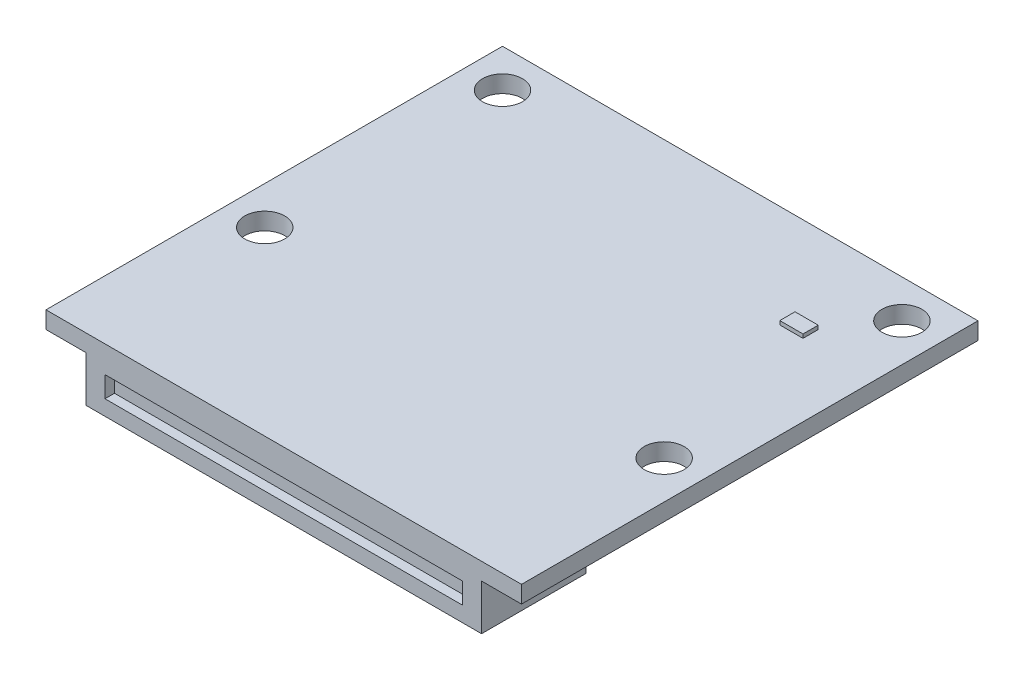
ISO-10303-21;
HEADER;
FILE_DESCRIPTION(('STEP AP214'),'2;1');
FILE_NAME('part.step','',(''),(''),'','','');
FILE_SCHEMA(('AUTOMOTIVE_DESIGN { 1 0 10303 214 1 1 1 1 }'));
ENDSEC;
DATA;
#1=APPLICATION_CONTEXT('core data for automotive mechanical design processes');
#2=APPLICATION_PROTOCOL_DEFINITION('international standard','automotive_design',2000,#1);
#3=PRODUCT_CONTEXT('',#1,'mechanical');
#4=PRODUCT('Part','Part','',(#3));
#5=PRODUCT_RELATED_PRODUCT_CATEGORY('part','',(#4));
#6=PRODUCT_DEFINITION_FORMATION('','',#4);
#7=PRODUCT_DEFINITION_CONTEXT('part definition',#1,'design');
#8=PRODUCT_DEFINITION('design','',#6,#7);
#9=PRODUCT_DEFINITION_SHAPE('','',#8);
#10=(LENGTH_UNIT() NAMED_UNIT(*) SI_UNIT(.MILLI.,.METRE.));
#11=(NAMED_UNIT(*) PLANE_ANGLE_UNIT() SI_UNIT($,.RADIAN.));
#12=(NAMED_UNIT(*) SI_UNIT($,.STERADIAN.) SOLID_ANGLE_UNIT());
#13=UNCERTAINTY_MEASURE_WITH_UNIT(LENGTH_MEASURE(1.E-05),#10,'distance_accuracy_value','');
#14=(GEOMETRIC_REPRESENTATION_CONTEXT(3) GLOBAL_UNCERTAINTY_ASSIGNED_CONTEXT((#13)) GLOBAL_UNIT_ASSIGNED_CONTEXT((#10,
#11,#12)) REPRESENTATION_CONTEXT('',''));
#15=CARTESIAN_POINT('',(0.,0.,0.));
#16=DIRECTION('',(0.,0.,1.));
#17=DIRECTION('',(1.,0.,0.));
#18=AXIS2_PLACEMENT_3D('',#15,#16,#17);
#19=CARTESIAN_POINT('',(0.,0.,0.));
#20=DIRECTION('',(0.,1.,0.));
#21=DIRECTION('',(0.,0.,1.));
#22=AXIS2_PLACEMENT_3D('',#19,#20,#21);
#23=PLANE('',#22);
#24=DIRECTION('',(0.,0.,1.));
#25=VECTOR('',#24,1.);
#26=CARTESIAN_POINT('',(-12.5,0.,-14.5));
#27=LINE('',#26,#25);
#28=CARTESIAN_POINT('',(-12.5,0.,-14.5));
#29=VERTEX_POINT('',#28);
#30=CARTESIAN_POINT('',(-12.5,0.,9.5));
#31=VERTEX_POINT('',#30);
#32=EDGE_CURVE('E272',#29,#31,#27,.T.);
#33=ORIENTED_EDGE('',*,*,#32,.T.);
#34=DIRECTION('',(1.,0.,0.));
#35=VECTOR('',#34,1.);
#36=CARTESIAN_POINT('',(-12.5,0.,9.5));
#37=LINE('',#36,#35);
#38=CARTESIAN_POINT('',(12.5,0.,9.5));
#39=VERTEX_POINT('',#38);
#40=EDGE_CURVE('E275',#31,#39,#37,.T.);
#41=ORIENTED_EDGE('',*,*,#40,.T.);
#42=DIRECTION('',(0.,0.,-1.));
#43=VECTOR('',#42,1.);
#44=CARTESIAN_POINT('',(12.5,0.,-14.5));
#45=LINE('',#44,#43);
#46=CARTESIAN_POINT('',(12.5,0.,-14.5));
#47=VERTEX_POINT('',#46);
#48=EDGE_CURVE('E279',#39,#47,#45,.T.);
#49=ORIENTED_EDGE('',*,*,#48,.T.);
#50=DIRECTION('',(-1.,0.,0.));
#51=VECTOR('',#50,1.);
#52=CARTESIAN_POINT('',(-12.5,0.,-14.5));
#53=LINE('',#52,#51);
#54=EDGE_CURVE('E282',#47,#29,#53,.T.);
#55=ORIENTED_EDGE('',*,*,#54,.T.);
#56=EDGE_LOOP('',(#33,#41,#49,#55));
#57=FACE_BOUND('',#56,.T.);
#58=CARTESIAN_POINT('',(10.5,0.,-12.5));
#59=DIRECTION('',(0.,1.,0.));
#60=DIRECTION('',(0.,0.,1.));
#61=AXIS2_PLACEMENT_3D('',#58,#59,#60);
#62=CIRCLE('',#61,1.05);
#63=CARTESIAN_POINT('',(10.5,0.,-11.45));
#64=VERTEX_POINT('',#63);
#65=EDGE_CURVE('E334',#64,#64,#62,.T.);
#66=ORIENTED_EDGE('',*,*,#65,.F.);
#67=EDGE_LOOP('',(#66));
#68=FACE_BOUND('',#67,.T.);
#69=CARTESIAN_POINT('',(10.5,0.,0.));
#70=DIRECTION('',(0.,1.,0.));
#71=DIRECTION('',(0.,0.,1.));
#72=AXIS2_PLACEMENT_3D('',#69,#70,#71);
#73=CIRCLE('',#72,1.05);
#74=CARTESIAN_POINT('',(10.5,0.,1.05));
#75=VERTEX_POINT('',#74);
#76=EDGE_CURVE('E328',#75,#75,#73,.T.);
#77=ORIENTED_EDGE('',*,*,#76,.F.);
#78=EDGE_LOOP('',(#77));
#79=FACE_BOUND('',#78,.T.);
#80=CARTESIAN_POINT('',(-10.5,0.,0.));
#81=DIRECTION('',(0.,1.,0.));
#82=DIRECTION('',(0.,0.,-1.));
#83=AXIS2_PLACEMENT_3D('',#80,#81,#82);
#84=CIRCLE('',#83,1.05);
#85=CARTESIAN_POINT('',(-10.5,0.,-1.05));
#86=VERTEX_POINT('',#85);
#87=EDGE_CURVE('E323',#86,#86,#84,.T.);
#88=ORIENTED_EDGE('',*,*,#87,.F.);
#89=EDGE_LOOP('',(#88));
#90=FACE_BOUND('',#89,.T.);
#91=CARTESIAN_POINT('',(-10.5,0.,-12.5));
#92=DIRECTION('',(0.,1.,0.));
#93=DIRECTION('',(0.,0.,-1.));
#94=AXIS2_PLACEMENT_3D('',#91,#92,#93);
#95=CIRCLE('',#94,1.05);
#96=CARTESIAN_POINT('',(-10.5,0.,-13.55));
#97=VERTEX_POINT('',#96);
#98=EDGE_CURVE('E317',#97,#97,#95,.T.);
#99=ORIENTED_EDGE('',*,*,#98,.F.);
#100=EDGE_LOOP('',(#99));
#101=FACE_BOUND('',#100,.T.);
#102=DIRECTION('',(-1.,0.,0.));
#103=VECTOR('',#102,1.);
#104=CARTESIAN_POINT('',(8.7,0.,-9.9));
#105=LINE('',#104,#103);
#106=CARTESIAN_POINT('',(8.7,0.,-9.9));
#107=VERTEX_POINT('',#106);
#108=CARTESIAN_POINT('',(7.48,0.,-9.9));
#109=VERTEX_POINT('',#108);
#110=EDGE_CURVE('E201',#107,#109,#105,.T.);
#111=ORIENTED_EDGE('',*,*,#110,.F.);
#112=DIRECTION('',(0.,0.,-1.));
#113=VECTOR('',#112,1.);
#114=CARTESIAN_POINT('',(8.7,0.,-9.1));
#115=LINE('',#114,#113);
#116=CARTESIAN_POINT('',(8.7,0.,-9.1));
#117=VERTEX_POINT('',#116);
#118=EDGE_CURVE('E184',#117,#107,#115,.T.);
#119=ORIENTED_EDGE('',*,*,#118,.F.);
#120=DIRECTION('',(1.,0.,0.));
#121=VECTOR('',#120,1.);
#122=CARTESIAN_POINT('',(8.7,0.,-9.1));
#123=LINE('',#122,#121);
#124=CARTESIAN_POINT('',(7.48,0.,-9.1));
#125=VERTEX_POINT('',#124);
#126=EDGE_CURVE('E192',#125,#117,#123,.T.);
#127=ORIENTED_EDGE('',*,*,#126,.F.);
#128=DIRECTION('',(0.,0.,1.));
#129=VECTOR('',#128,1.);
#130=CARTESIAN_POINT('',(7.48,0.,-9.1));
#131=LINE('',#130,#129);
#132=EDGE_CURVE('E203',#109,#125,#131,.T.);
#133=ORIENTED_EDGE('',*,*,#132,.F.);
#134=EDGE_LOOP('',(#111,#119,#127,#133));
#135=FACE_BOUND('',#134,.T.);
#136=ADVANCED_FACE('F34',(#57,#68,#79,#90,#101,#135),#23,.T.);
#137=CARTESIAN_POINT('',(0.,-0.9,0.));
#138=DIRECTION('',(0.,1.,0.));
#139=DIRECTION('',(0.,0.,1.));
#140=AXIS2_PLACEMENT_3D('',#137,#138,#139);
#141=PLANE('',#140);
#142=CARTESIAN_POINT('',(10.5,-0.9,-12.5));
#143=DIRECTION('',(0.,1.,0.));
#144=DIRECTION('',(0.,0.,1.));
#145=AXIS2_PLACEMENT_3D('',#142,#143,#144);
#146=CIRCLE('',#145,1.05);
#147=CARTESIAN_POINT('',(10.5,-0.9,-11.45));
#148=VERTEX_POINT('',#147);
#149=EDGE_CURVE('E276',#148,#148,#146,.T.);
#150=ORIENTED_EDGE('',*,*,#149,.T.);
#151=EDGE_LOOP('',(#150));
#152=FACE_BOUND('',#151,.T.);
#153=CARTESIAN_POINT('',(10.5,-0.9,0.));
#154=DIRECTION('',(0.,1.,0.));
#155=DIRECTION('',(0.,0.,1.));
#156=AXIS2_PLACEMENT_3D('',#153,#154,#155);
#157=CIRCLE('',#156,1.05);
#158=CARTESIAN_POINT('',(10.5,-0.9,1.05));
#159=VERTEX_POINT('',#158);
#160=EDGE_CURVE('E331',#159,#159,#157,.T.);
#161=ORIENTED_EDGE('',*,*,#160,.T.);
#162=EDGE_LOOP('',(#161));
#163=FACE_BOUND('',#162,.T.);
#164=CARTESIAN_POINT('',(-10.5,-0.9,0.));
#165=DIRECTION('',(0.,1.,0.));
#166=DIRECTION('',(0.,0.,-1.));
#167=AXIS2_PLACEMENT_3D('',#164,#165,#166);
#168=CIRCLE('',#167,1.05);
#169=CARTESIAN_POINT('',(-10.5,-0.9,-1.05));
#170=VERTEX_POINT('',#169);
#171=EDGE_CURVE('E325',#170,#170,#168,.T.);
#172=ORIENTED_EDGE('',*,*,#171,.T.);
#173=EDGE_LOOP('',(#172));
#174=FACE_BOUND('',#173,.T.);
#175=CARTESIAN_POINT('',(-10.5,-0.9,-12.5));
#176=DIRECTION('',(0.,1.,0.));
#177=DIRECTION('',(0.,0.,-1.));
#178=AXIS2_PLACEMENT_3D('',#175,#176,#177);
#179=CIRCLE('',#178,1.05);
#180=CARTESIAN_POINT('',(-10.5,-0.9,-13.55));
#181=VERTEX_POINT('',#180);
#182=EDGE_CURVE('E319',#181,#181,#179,.T.);
#183=ORIENTED_EDGE('',*,*,#182,.T.);
#184=EDGE_LOOP('',(#183));
#185=FACE_BOUND('',#184,.T.);
#186=DIRECTION('',(0.,0.,-1.));
#187=VECTOR('',#186,1.);
#188=CARTESIAN_POINT('',(-10.4,-0.9,9.5));
#189=LINE('',#188,#187);
#190=CARTESIAN_POINT('',(-10.4,-0.9,9.5));
#191=VERTEX_POINT('',#190);
#192=CARTESIAN_POINT('',(-10.4,-0.9,4.));
#193=VERTEX_POINT('',#192);
#194=EDGE_CURVE('E214',#191,#193,#189,.T.);
#195=ORIENTED_EDGE('',*,*,#194,.F.);
#196=DIRECTION('',(1.,0.,0.));
#197=VECTOR('',#196,1.);
#198=CARTESIAN_POINT('',(-12.5,-0.9,9.5));
#199=LINE('',#198,#197);
#200=CARTESIAN_POINT('',(-12.5,-0.9,9.5));
#201=VERTEX_POINT('',#200);
#202=EDGE_CURVE('E257',#201,#191,#199,.T.);
#203=ORIENTED_EDGE('',*,*,#202,.F.);
#204=DIRECTION('',(0.,0.,1.));
#205=VECTOR('',#204,1.);
#206=CARTESIAN_POINT('',(-12.5,-0.9,-14.5));
#207=LINE('',#206,#205);
#208=CARTESIAN_POINT('',(-12.5,-0.9,-14.5));
#209=VERTEX_POINT('',#208);
#210=EDGE_CURVE('E258',#209,#201,#207,.T.);
#211=ORIENTED_EDGE('',*,*,#210,.F.);
#212=DIRECTION('',(-1.,0.,0.));
#213=VECTOR('',#212,1.);
#214=CARTESIAN_POINT('',(-12.5,-0.9,-14.5));
#215=LINE('',#214,#213);
#216=CARTESIAN_POINT('',(12.5,-0.9,-14.5));
#217=VERTEX_POINT('',#216);
#218=EDGE_CURVE('E268',#217,#209,#215,.T.);
#219=ORIENTED_EDGE('',*,*,#218,.F.);
#220=DIRECTION('',(0.,0.,-1.));
#221=VECTOR('',#220,1.);
#222=CARTESIAN_POINT('',(12.5,-0.9,-14.5));
#223=LINE('',#222,#221);
#224=CARTESIAN_POINT('',(12.5,-0.9,9.5));
#225=VERTEX_POINT('',#224);
#226=EDGE_CURVE('E264',#225,#217,#223,.T.);
#227=ORIENTED_EDGE('',*,*,#226,.F.);
#228=CARTESIAN_POINT('',(10.4,-0.9,9.5));
#229=VERTEX_POINT('',#228);
#230=EDGE_CURVE('E254',#229,#225,#199,.T.);
#231=ORIENTED_EDGE('',*,*,#230,.F.);
#232=DIRECTION('',(0.,0.,1.));
#233=VECTOR('',#232,1.);
#234=CARTESIAN_POINT('',(10.4,-0.9,9.5));
#235=LINE('',#234,#233);
#236=CARTESIAN_POINT('',(10.4,-0.9,4.));
#237=VERTEX_POINT('',#236);
#238=EDGE_CURVE('E219',#237,#229,#235,.T.);
#239=ORIENTED_EDGE('',*,*,#238,.F.);
#240=DIRECTION('',(1.,0.,0.));
#241=VECTOR('',#240,1.);
#242=CARTESIAN_POINT('',(-10.4,-0.9,4.));
#243=LINE('',#242,#241);
#244=EDGE_CURVE('E226',#193,#237,#243,.T.);
#245=ORIENTED_EDGE('',*,*,#244,.F.);
#246=EDGE_LOOP('',(#195,#203,#211,#219,#227,#231,#239,#245));
#247=FACE_BOUND('',#246,.T.);
#248=ADVANCED_FACE('F304',(#152,#163,#174,#185,#247),#141,.F.);
#249=CARTESIAN_POINT('',(-12.5,-0.9,-14.5));
#250=DIRECTION('',(-1.,0.,0.));
#251=DIRECTION('',(0.,0.,1.));
#252=AXIS2_PLACEMENT_3D('',#249,#250,#251);
#253=PLANE('',#252);
#254=ORIENTED_EDGE('',*,*,#32,.F.);
#255=DIRECTION('',(0.,1.,0.));
#256=VECTOR('',#255,1.);
#257=CARTESIAN_POINT('',(-12.5,-0.9,-14.5));
#258=LINE('',#257,#256);
#259=EDGE_CURVE('E11',#209,#29,#258,.T.);
#260=ORIENTED_EDGE('',*,*,#259,.F.);
#261=ORIENTED_EDGE('',*,*,#210,.T.);
#262=DIRECTION('',(0.,1.,0.));
#263=VECTOR('',#262,1.);
#264=CARTESIAN_POINT('',(-12.5,-0.9,9.5));
#265=LINE('',#264,#263);
#266=EDGE_CURVE('E271',#201,#31,#265,.T.);
#267=ORIENTED_EDGE('',*,*,#266,.T.);
#268=EDGE_LOOP('',(#254,#260,#261,#267));
#269=FACE_BOUND('',#268,.T.);
#270=ADVANCED_FACE('F36',(#269),#253,.T.);
#271=CARTESIAN_POINT('',(-12.5,-0.9,-14.5));
#272=DIRECTION('',(0.,0.,-1.));
#273=DIRECTION('',(-1.,0.,0.));
#274=AXIS2_PLACEMENT_3D('',#271,#272,#273);
#275=PLANE('',#274);
#276=ORIENTED_EDGE('',*,*,#54,.F.);
#277=DIRECTION('',(0.,1.,0.));
#278=VECTOR('',#277,1.);
#279=CARTESIAN_POINT('',(12.5,-0.9,-14.5));
#280=LINE('',#279,#278);
#281=EDGE_CURVE('E43',#217,#47,#280,.T.);
#282=ORIENTED_EDGE('',*,*,#281,.F.);
#283=ORIENTED_EDGE('',*,*,#218,.T.);
#284=ORIENTED_EDGE('',*,*,#259,.T.);
#285=EDGE_LOOP('',(#276,#282,#283,#284));
#286=FACE_BOUND('',#285,.T.);
#287=ADVANCED_FACE('F301',(#286),#275,.T.);
#288=CARTESIAN_POINT('',(12.5,-0.9,-14.5));
#289=DIRECTION('',(1.,0.,0.));
#290=DIRECTION('',(0.,0.,-1.));
#291=AXIS2_PLACEMENT_3D('',#288,#289,#290);
#292=PLANE('',#291);
#293=ORIENTED_EDGE('',*,*,#48,.F.);
#294=DIRECTION('',(0.,1.,0.));
#295=VECTOR('',#294,1.);
#296=CARTESIAN_POINT('',(12.5,-0.9,9.5));
#297=LINE('',#296,#295);
#298=EDGE_CURVE('E286',#225,#39,#297,.T.);
#299=ORIENTED_EDGE('',*,*,#298,.F.);
#300=ORIENTED_EDGE('',*,*,#226,.T.);
#301=ORIENTED_EDGE('',*,*,#281,.T.);
#302=EDGE_LOOP('',(#293,#299,#300,#301));
#303=FACE_BOUND('',#302,.T.);
#304=ADVANCED_FACE('F411',(#303),#292,.T.);
#305=CARTESIAN_POINT('',(-12.5,-0.9,9.5));
#306=DIRECTION('',(0.,0.,1.));
#307=DIRECTION('',(1.,0.,0.));
#308=AXIS2_PLACEMENT_3D('',#305,#306,#307);
#309=PLANE('',#308);
#310=DIRECTION('',(0.,-1.,0.));
#311=VECTOR('',#310,1.);
#312=CARTESIAN_POINT('',(-9.4,-1.4,9.5));
#313=LINE('',#312,#311);
#314=CARTESIAN_POINT('',(-9.4,-1.4,9.5));
#315=VERTEX_POINT('',#314);
#316=CARTESIAN_POINT('',(-9.4,-2.5,9.5));
#317=VERTEX_POINT('',#316);
#318=EDGE_CURVE('E51',#315,#317,#313,.T.);
#319=ORIENTED_EDGE('',*,*,#318,.F.);
#320=DIRECTION('',(-1.,0.,0.));
#321=VECTOR('',#320,1.);
#322=CARTESIAN_POINT('',(-9.4,-1.4,9.5));
#323=LINE('',#322,#321);
#324=CARTESIAN_POINT('',(9.4,-1.4,9.5));
#325=VERTEX_POINT('',#324);
#326=EDGE_CURVE('E169',#325,#315,#323,.T.);
#327=ORIENTED_EDGE('',*,*,#326,.F.);
#328=DIRECTION('',(0.,1.,0.));
#329=VECTOR('',#328,1.);
#330=CARTESIAN_POINT('',(9.4,-1.4,9.5));
#331=LINE('',#330,#329);
#332=CARTESIAN_POINT('',(9.4,-2.5,9.5));
#333=VERTEX_POINT('',#332);
#334=EDGE_CURVE('E172',#333,#325,#331,.T.);
#335=ORIENTED_EDGE('',*,*,#334,.F.);
#336=DIRECTION('',(1.,0.,0.));
#337=VECTOR('',#336,1.);
#338=CARTESIAN_POINT('',(-9.4,-2.5,9.5));
#339=LINE('',#338,#337);
#340=EDGE_CURVE('E178',#317,#333,#339,.T.);
#341=ORIENTED_EDGE('',*,*,#340,.F.);
#342=EDGE_LOOP('',(#319,#327,#335,#341));
#343=FACE_BOUND('',#342,.T.);
#344=ORIENTED_EDGE('',*,*,#40,.F.);
#345=ORIENTED_EDGE('',*,*,#266,.F.);
#346=ORIENTED_EDGE('',*,*,#202,.T.);
#347=DIRECTION('',(0.,1.,0.));
#348=VECTOR('',#347,1.);
#349=CARTESIAN_POINT('',(-10.4,-3.3,9.5));
#350=LINE('',#349,#348);
#351=CARTESIAN_POINT('',(-10.4,-3.3,9.5));
#352=VERTEX_POINT('',#351);
#353=EDGE_CURVE('E225',#352,#191,#350,.T.);
#354=ORIENTED_EDGE('',*,*,#353,.F.);
#355=DIRECTION('',(-1.,0.,0.));
#356=VECTOR('',#355,1.);
#357=CARTESIAN_POINT('',(-10.4,-3.3,9.5));
#358=LINE('',#357,#356);
#359=CARTESIAN_POINT('',(10.4,-3.3,9.5));
#360=VERTEX_POINT('',#359);
#361=EDGE_CURVE('E223',#360,#352,#358,.T.);
#362=ORIENTED_EDGE('',*,*,#361,.F.);
#363=DIRECTION('',(0.,1.,0.));
#364=VECTOR('',#363,1.);
#365=CARTESIAN_POINT('',(10.4,-3.3,9.5));
#366=LINE('',#365,#364);
#367=EDGE_CURVE('E238',#360,#229,#366,.T.);
#368=ORIENTED_EDGE('',*,*,#367,.T.);
#369=ORIENTED_EDGE('',*,*,#230,.T.);
#370=ORIENTED_EDGE('',*,*,#298,.T.);
#371=EDGE_LOOP('',(#344,#345,#346,#354,#362,#368,#369,#370));
#372=FACE_BOUND('',#371,.T.);
#373=ADVANCED_FACE('F294',(#343,#372),#309,.T.);
#374=CARTESIAN_POINT('',(10.5,-0.9,-12.5));
#375=DIRECTION('',(0.,1.,0.));
#376=DIRECTION('',(0.,0.,1.));
#377=AXIS2_PLACEMENT_3D('',#374,#375,#376);
#378=CYLINDRICAL_SURFACE('',#377,1.05);
#379=ORIENTED_EDGE('',*,*,#149,.F.);
#380=EDGE_LOOP('',(#379));
#381=FACE_BOUND('',#380,.T.);
#382=ORIENTED_EDGE('',*,*,#65,.T.);
#383=EDGE_LOOP('',(#382));
#384=FACE_BOUND('',#383,.T.);
#385=ADVANCED_FACE('F341',(#381,#384),#378,.F.);
#386=CARTESIAN_POINT('',(10.5,-0.9,0.));
#387=DIRECTION('',(0.,1.,0.));
#388=DIRECTION('',(0.,0.,1.));
#389=AXIS2_PLACEMENT_3D('',#386,#387,#388);
#390=CYLINDRICAL_SURFACE('',#389,1.05);
#391=ORIENTED_EDGE('',*,*,#160,.F.);
#392=EDGE_LOOP('',(#391));
#393=FACE_BOUND('',#392,.T.);
#394=ORIENTED_EDGE('',*,*,#76,.T.);
#395=EDGE_LOOP('',(#394));
#396=FACE_BOUND('',#395,.T.);
#397=ADVANCED_FACE('F398',(#393,#396),#390,.F.);
#398=CARTESIAN_POINT('',(-10.5,-0.9,0.));
#399=DIRECTION('',(0.,1.,0.));
#400=DIRECTION('',(0.,0.,1.));
#401=AXIS2_PLACEMENT_3D('',#398,#399,#400);
#402=CYLINDRICAL_SURFACE('',#401,1.05);
#403=ORIENTED_EDGE('',*,*,#171,.F.);
#404=EDGE_LOOP('',(#403));
#405=FACE_BOUND('',#404,.T.);
#406=ORIENTED_EDGE('',*,*,#87,.T.);
#407=EDGE_LOOP('',(#406));
#408=FACE_BOUND('',#407,.T.);
#409=ADVANCED_FACE('F394',(#405,#408),#402,.F.);
#410=CARTESIAN_POINT('',(-10.5,-0.9,-12.5));
#411=DIRECTION('',(0.,1.,0.));
#412=DIRECTION('',(0.,0.,1.));
#413=AXIS2_PLACEMENT_3D('',#410,#411,#412);
#414=CYLINDRICAL_SURFACE('',#413,1.05);
#415=ORIENTED_EDGE('',*,*,#182,.F.);
#416=EDGE_LOOP('',(#415));
#417=FACE_BOUND('',#416,.T.);
#418=ORIENTED_EDGE('',*,*,#98,.T.);
#419=EDGE_LOOP('',(#418));
#420=FACE_BOUND('',#419,.T.);
#421=ADVANCED_FACE('F391',(#417,#420),#414,.F.);
#422=CARTESIAN_POINT('',(-10.4,-3.3,9.5));
#423=DIRECTION('',(1.,0.,0.));
#424=DIRECTION('',(0.,0.,-1.));
#425=AXIS2_PLACEMENT_3D('',#422,#423,#424);
#426=PLANE('',#425);
#427=ORIENTED_EDGE('',*,*,#194,.T.);
#428=DIRECTION('',(0.,1.,0.));
#429=VECTOR('',#428,1.);
#430=CARTESIAN_POINT('',(-10.4,-3.3,4.));
#431=LINE('',#430,#429);
#432=CARTESIAN_POINT('',(-10.4,-3.3,4.));
#433=VERTEX_POINT('',#432);
#434=EDGE_CURVE('E244',#433,#193,#431,.T.);
#435=ORIENTED_EDGE('',*,*,#434,.F.);
#436=DIRECTION('',(0.,0.,-1.));
#437=VECTOR('',#436,1.);
#438=CARTESIAN_POINT('',(-10.4,-3.3,9.5));
#439=LINE('',#438,#437);
#440=EDGE_CURVE('E215',#352,#433,#439,.T.);
#441=ORIENTED_EDGE('',*,*,#440,.F.);
#442=ORIENTED_EDGE('',*,*,#353,.T.);
#443=EDGE_LOOP('',(#427,#435,#441,#442));
#444=FACE_BOUND('',#443,.T.);
#445=ADVANCED_FACE('F307',(#444),#426,.F.);
#446=CARTESIAN_POINT('',(-10.4,-3.3,4.));
#447=DIRECTION('',(0.,0.,1.));
#448=DIRECTION('',(1.,0.,0.));
#449=AXIS2_PLACEMENT_3D('',#446,#447,#448);
#450=PLANE('',#449);
#451=ORIENTED_EDGE('',*,*,#244,.T.);
#452=DIRECTION('',(0.,1.,0.));
#453=VECTOR('',#452,1.);
#454=CARTESIAN_POINT('',(10.4,-3.3,4.));
#455=LINE('',#454,#453);
#456=CARTESIAN_POINT('',(10.4,-3.3,4.));
#457=VERTEX_POINT('',#456);
#458=EDGE_CURVE('E231',#457,#237,#455,.T.);
#459=ORIENTED_EDGE('',*,*,#458,.F.);
#460=DIRECTION('',(1.,0.,0.));
#461=VECTOR('',#460,1.);
#462=CARTESIAN_POINT('',(-10.4,-3.3,4.));
#463=LINE('',#462,#461);
#464=EDGE_CURVE('E218',#433,#457,#463,.T.);
#465=ORIENTED_EDGE('',*,*,#464,.F.);
#466=ORIENTED_EDGE('',*,*,#434,.T.);
#467=EDGE_LOOP('',(#451,#459,#465,#466));
#468=FACE_BOUND('',#467,.T.);
#469=ADVANCED_FACE('F316',(#468),#450,.F.);
#470=CARTESIAN_POINT('',(10.4,-3.3,9.5));
#471=DIRECTION('',(-1.,0.,0.));
#472=DIRECTION('',(0.,0.,1.));
#473=AXIS2_PLACEMENT_3D('',#470,#471,#472);
#474=PLANE('',#473);
#475=ORIENTED_EDGE('',*,*,#238,.T.);
#476=ORIENTED_EDGE('',*,*,#367,.F.);
#477=DIRECTION('',(0.,0.,1.));
#478=VECTOR('',#477,1.);
#479=CARTESIAN_POINT('',(10.4,-3.3,9.5));
#480=LINE('',#479,#478);
#481=EDGE_CURVE('E221',#457,#360,#480,.T.);
#482=ORIENTED_EDGE('',*,*,#481,.F.);
#483=ORIENTED_EDGE('',*,*,#458,.T.);
#484=EDGE_LOOP('',(#475,#476,#482,#483));
#485=FACE_BOUND('',#484,.T.);
#486=ADVANCED_FACE('F314',(#485),#474,.F.);
#487=CARTESIAN_POINT('',(0.,-3.3,0.));
#488=DIRECTION('',(0.,-1.,0.));
#489=DIRECTION('',(0.,0.,-1.));
#490=AXIS2_PLACEMENT_3D('',#487,#488,#489);
#491=PLANE('',#490);
#492=ORIENTED_EDGE('',*,*,#440,.T.);
#493=ORIENTED_EDGE('',*,*,#464,.T.);
#494=ORIENTED_EDGE('',*,*,#481,.T.);
#495=ORIENTED_EDGE('',*,*,#361,.T.);
#496=EDGE_LOOP('',(#492,#493,#494,#495));
#497=FACE_BOUND('',#496,.T.);
#498=ADVANCED_FACE('F310',(#497),#491,.T.);
#499=CARTESIAN_POINT('',(8.7,0.2,-9.1));
#500=DIRECTION('',(-1.,0.,0.));
#501=DIRECTION('',(0.,0.,1.));
#502=AXIS2_PLACEMENT_3D('',#499,#500,#501);
#503=PLANE('',#502);
#504=ORIENTED_EDGE('',*,*,#118,.T.);
#505=DIRECTION('',(0.,-1.,0.));
#506=VECTOR('',#505,1.);
#507=CARTESIAN_POINT('',(8.7,0.2,-9.9));
#508=LINE('',#507,#506);
#509=CARTESIAN_POINT('',(8.7,0.2,-9.9));
#510=VERTEX_POINT('',#509);
#511=EDGE_CURVE('E212',#510,#107,#508,.T.);
#512=ORIENTED_EDGE('',*,*,#511,.F.);
#513=DIRECTION('',(0.,0.,-1.));
#514=VECTOR('',#513,1.);
#515=CARTESIAN_POINT('',(8.7,0.2,-9.1));
#516=LINE('',#515,#514);
#517=CARTESIAN_POINT('',(8.7,0.2,-9.1));
#518=VERTEX_POINT('',#517);
#519=EDGE_CURVE('E188',#518,#510,#516,.T.);
#520=ORIENTED_EDGE('',*,*,#519,.F.);
#521=DIRECTION('',(0.,-1.,0.));
#522=VECTOR('',#521,1.);
#523=CARTESIAN_POINT('',(8.7,0.2,-9.1));
#524=LINE('',#523,#522);
#525=EDGE_CURVE('E198',#518,#117,#524,.T.);
#526=ORIENTED_EDGE('',*,*,#525,.T.);
#527=EDGE_LOOP('',(#504,#512,#520,#526));
#528=FACE_BOUND('',#527,.T.);
#529=ADVANCED_FACE('F367',(#528),#503,.F.);
#530=CARTESIAN_POINT('',(8.7,0.2,-9.9));
#531=DIRECTION('',(0.,0.,1.));
#532=DIRECTION('',(1.,0.,0.));
#533=AXIS2_PLACEMENT_3D('',#530,#531,#532);
#534=PLANE('',#533);
#535=ORIENTED_EDGE('',*,*,#110,.T.);
#536=DIRECTION('',(0.,-1.,0.));
#537=VECTOR('',#536,1.);
#538=CARTESIAN_POINT('',(7.48,0.2,-9.9));
#539=LINE('',#538,#537);
#540=CARTESIAN_POINT('',(7.48,0.2,-9.9));
#541=VERTEX_POINT('',#540);
#542=EDGE_CURVE('E209',#541,#109,#539,.T.);
#543=ORIENTED_EDGE('',*,*,#542,.F.);
#544=DIRECTION('',(-1.,0.,0.));
#545=VECTOR('',#544,1.);
#546=CARTESIAN_POINT('',(8.7,0.2,-9.9));
#547=LINE('',#546,#545);
#548=EDGE_CURVE('E191',#510,#541,#547,.T.);
#549=ORIENTED_EDGE('',*,*,#548,.F.);
#550=ORIENTED_EDGE('',*,*,#511,.T.);
#551=EDGE_LOOP('',(#535,#543,#549,#550));
#552=FACE_BOUND('',#551,.T.);
#553=ADVANCED_FACE('F357',(#552),#534,.F.);
#554=CARTESIAN_POINT('',(7.48,0.2,-9.1));
#555=DIRECTION('',(1.,0.,0.));
#556=DIRECTION('',(0.,0.,-1.));
#557=AXIS2_PLACEMENT_3D('',#554,#555,#556);
#558=PLANE('',#557);
#559=ORIENTED_EDGE('',*,*,#132,.T.);
#560=DIRECTION('',(0.,-1.,0.));
#561=VECTOR('',#560,1.);
#562=CARTESIAN_POINT('',(7.48,0.2,-9.1));
#563=LINE('',#562,#561);
#564=CARTESIAN_POINT('',(7.48,0.2,-9.1));
#565=VERTEX_POINT('',#564);
#566=EDGE_CURVE('E59',#565,#125,#563,.T.);
#567=ORIENTED_EDGE('',*,*,#566,.F.);
#568=DIRECTION('',(0.,0.,1.));
#569=VECTOR('',#568,1.);
#570=CARTESIAN_POINT('',(7.48,0.2,-9.1));
#571=LINE('',#570,#569);
#572=EDGE_CURVE('E194',#541,#565,#571,.T.);
#573=ORIENTED_EDGE('',*,*,#572,.F.);
#574=ORIENTED_EDGE('',*,*,#542,.T.);
#575=EDGE_LOOP('',(#559,#567,#573,#574));
#576=FACE_BOUND('',#575,.T.);
#577=ADVANCED_FACE('F361',(#576),#558,.F.);
#578=CARTESIAN_POINT('',(8.7,0.2,-9.1));
#579=DIRECTION('',(0.,0.,-1.));
#580=DIRECTION('',(-1.,0.,0.));
#581=AXIS2_PLACEMENT_3D('',#578,#579,#580);
#582=PLANE('',#581);
#583=ORIENTED_EDGE('',*,*,#126,.T.);
#584=ORIENTED_EDGE('',*,*,#525,.F.);
#585=DIRECTION('',(1.,0.,0.));
#586=VECTOR('',#585,1.);
#587=CARTESIAN_POINT('',(8.7,0.2,-9.1));
#588=LINE('',#587,#586);
#589=EDGE_CURVE('E196',#565,#518,#588,.T.);
#590=ORIENTED_EDGE('',*,*,#589,.F.);
#591=ORIENTED_EDGE('',*,*,#566,.T.);
#592=EDGE_LOOP('',(#583,#584,#590,#591));
#593=FACE_BOUND('',#592,.T.);
#594=ADVANCED_FACE('F368',(#593),#582,.F.);
#595=CARTESIAN_POINT('',(0.,0.2,0.));
#596=DIRECTION('',(0.,1.,0.));
#597=DIRECTION('',(0.,0.,1.));
#598=AXIS2_PLACEMENT_3D('',#595,#596,#597);
#599=PLANE('',#598);
#600=ORIENTED_EDGE('',*,*,#519,.T.);
#601=ORIENTED_EDGE('',*,*,#548,.T.);
#602=ORIENTED_EDGE('',*,*,#572,.T.);
#603=ORIENTED_EDGE('',*,*,#589,.T.);
#604=EDGE_LOOP('',(#600,#601,#602,#603));
#605=FACE_BOUND('',#604,.T.);
#606=ADVANCED_FACE('F363',(#605),#599,.T.);
#607=CARTESIAN_POINT('',(-9.4,-1.4,9.));
#608=DIRECTION('',(-1.,0.,0.));
#609=DIRECTION('',(0.,0.,1.));
#610=AXIS2_PLACEMENT_3D('',#607,#608,#609);
#611=PLANE('',#610);
#612=ORIENTED_EDGE('',*,*,#318,.T.);
#613=DIRECTION('',(0.,0.,1.));
#614=VECTOR('',#613,1.);
#615=CARTESIAN_POINT('',(-9.4,-2.5,9.));
#616=LINE('',#615,#614);
#617=CARTESIAN_POINT('',(-9.4,-2.5,9.));
#618=VERTEX_POINT('',#617);
#619=EDGE_CURVE('E147',#618,#317,#616,.T.);
#620=ORIENTED_EDGE('',*,*,#619,.F.);
#621=DIRECTION('',(0.,-1.,0.));
#622=VECTOR('',#621,1.);
#623=CARTESIAN_POINT('',(-9.4,-1.4,9.));
#624=LINE('',#623,#622);
#625=CARTESIAN_POINT('',(-9.4,-1.4,9.));
#626=VERTEX_POINT('',#625);
#627=EDGE_CURVE('E151',#626,#618,#624,.T.);
#628=ORIENTED_EDGE('',*,*,#627,.F.);
#629=DIRECTION('',(0.,0.,1.));
#630=VECTOR('',#629,1.);
#631=CARTESIAN_POINT('',(-9.4,-1.4,9.));
#632=LINE('',#631,#630);
#633=EDGE_CURVE('E182',#626,#315,#632,.T.);
#634=ORIENTED_EDGE('',*,*,#633,.T.);
#635=EDGE_LOOP('',(#612,#620,#628,#634));
#636=FACE_BOUND('',#635,.T.);
#637=ADVANCED_FACE('F149',(#636),#611,.F.);
#638=CARTESIAN_POINT('',(-9.4,-1.4,9.));
#639=DIRECTION('',(0.,1.,0.));
#640=DIRECTION('',(0.,0.,1.));
#641=AXIS2_PLACEMENT_3D('',#638,#639,#640);
#642=PLANE('',#641);
#643=ORIENTED_EDGE('',*,*,#326,.T.);
#644=ORIENTED_EDGE('',*,*,#633,.F.);
#645=DIRECTION('',(-1.,0.,0.));
#646=VECTOR('',#645,1.);
#647=CARTESIAN_POINT('',(-9.4,-1.4,9.));
#648=LINE('',#647,#646);
#649=CARTESIAN_POINT('',(9.4,-1.4,9.));
#650=VERTEX_POINT('',#649);
#651=EDGE_CURVE('E157',#650,#626,#648,.T.);
#652=ORIENTED_EDGE('',*,*,#651,.F.);
#653=DIRECTION('',(0.,0.,1.));
#654=VECTOR('',#653,1.);
#655=CARTESIAN_POINT('',(9.4,-1.4,9.));
#656=LINE('',#655,#654);
#657=EDGE_CURVE('E185',#650,#325,#656,.T.);
#658=ORIENTED_EDGE('',*,*,#657,.T.);
#659=EDGE_LOOP('',(#643,#644,#652,#658));
#660=FACE_BOUND('',#659,.T.);
#661=ADVANCED_FACE('F425',(#660),#642,.F.);
#662=CARTESIAN_POINT('',(9.4,-1.4,9.));
#663=DIRECTION('',(1.,0.,0.));
#664=DIRECTION('',(0.,0.,-1.));
#665=AXIS2_PLACEMENT_3D('',#662,#663,#664);
#666=PLANE('',#665);
#667=ORIENTED_EDGE('',*,*,#334,.T.);
#668=ORIENTED_EDGE('',*,*,#657,.F.);
#669=DIRECTION('',(0.,1.,0.));
#670=VECTOR('',#669,1.);
#671=CARTESIAN_POINT('',(9.4,-1.4,9.));
#672=LINE('',#671,#670);
#673=CARTESIAN_POINT('',(9.4,-2.5,9.));
#674=VERTEX_POINT('',#673);
#675=EDGE_CURVE('E165',#674,#650,#672,.T.);
#676=ORIENTED_EDGE('',*,*,#675,.F.);
#677=DIRECTION('',(0.,0.,1.));
#678=VECTOR('',#677,1.);
#679=CARTESIAN_POINT('',(9.4,-2.5,9.));
#680=LINE('',#679,#678);
#681=EDGE_CURVE('E156',#674,#333,#680,.T.);
#682=ORIENTED_EDGE('',*,*,#681,.T.);
#683=EDGE_LOOP('',(#667,#668,#676,#682));
#684=FACE_BOUND('',#683,.T.);
#685=ADVANCED_FACE('F423',(#684),#666,.F.);
#686=CARTESIAN_POINT('',(-9.4,-2.5,9.));
#687=DIRECTION('',(0.,-1.,0.));
#688=DIRECTION('',(0.,0.,-1.));
#689=AXIS2_PLACEMENT_3D('',#686,#687,#688);
#690=PLANE('',#689);
#691=ORIENTED_EDGE('',*,*,#340,.T.);
#692=ORIENTED_EDGE('',*,*,#681,.F.);
#693=DIRECTION('',(1.,0.,0.));
#694=VECTOR('',#693,1.);
#695=CARTESIAN_POINT('',(-9.4,-2.5,9.));
#696=LINE('',#695,#694);
#697=EDGE_CURVE('E160',#618,#674,#696,.T.);
#698=ORIENTED_EDGE('',*,*,#697,.F.);
#699=ORIENTED_EDGE('',*,*,#619,.T.);
#700=EDGE_LOOP('',(#691,#692,#698,#699));
#701=FACE_BOUND('',#700,.T.);
#702=ADVANCED_FACE('F161',(#701),#690,.F.);
#703=CARTESIAN_POINT('',(0.,0.,9.));
#704=DIRECTION('',(0.,0.,1.));
#705=DIRECTION('',(1.,0.,0.));
#706=AXIS2_PLACEMENT_3D('',#703,#704,#705);
#707=PLANE('',#706);
#708=ORIENTED_EDGE('',*,*,#627,.T.);
#709=ORIENTED_EDGE('',*,*,#697,.T.);
#710=ORIENTED_EDGE('',*,*,#675,.T.);
#711=ORIENTED_EDGE('',*,*,#651,.T.);
#712=EDGE_LOOP('',(#708,#709,#710,#711));
#713=FACE_BOUND('',#712,.T.);
#714=ADVANCED_FACE('F167',(#713),#707,.T.);
#715=CLOSED_SHELL('',(#136,#248,#270,#287,#304,#373,#385,#397,#409,#421,#445,#469,#486,#498,
#529,#553,#577,#594,#606,#637,#661,#685,#702,#714));
#716=MANIFOLD_SOLID_BREP('B2',#715);
#717=ADVANCED_BREP_SHAPE_REPRESENTATION('',(#18,#716),#14);
#718=SHAPE_DEFINITION_REPRESENTATION(#9,#717);
ENDSEC;
END-ISO-10303-21;
